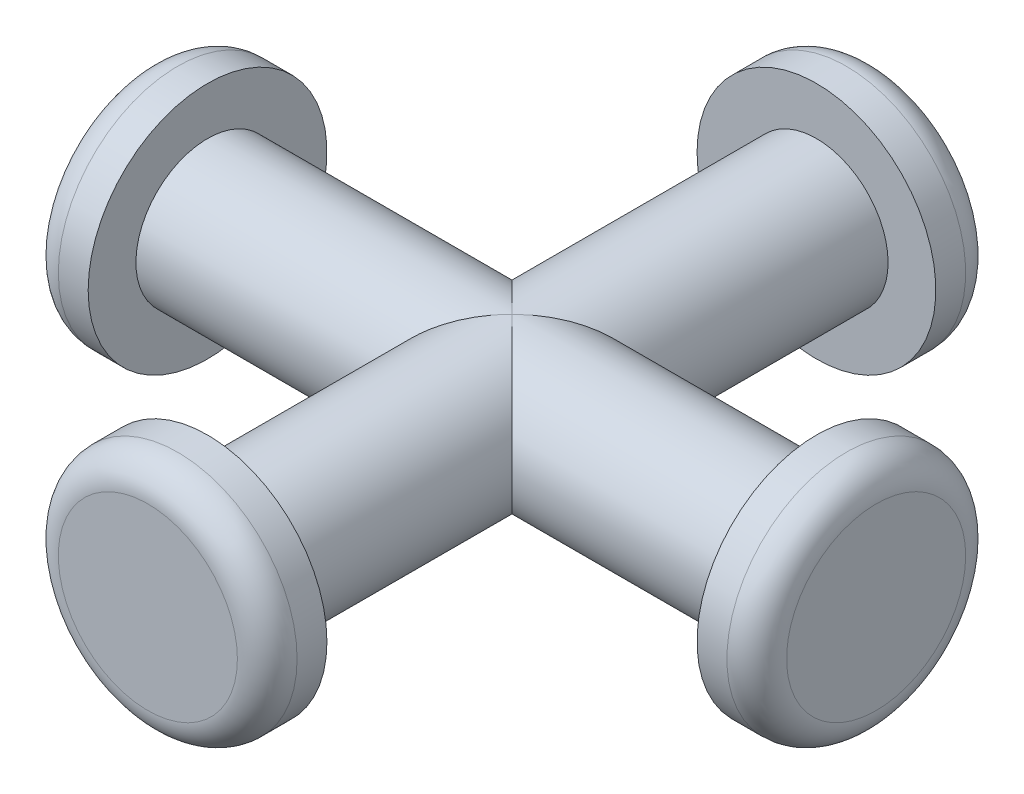
ISO-10303-21;
HEADER;
FILE_DESCRIPTION(('STEP AP214'),'2;1');
FILE_NAME('part.step','',(''),(''),'','','');
FILE_SCHEMA(('AUTOMOTIVE_DESIGN { 1 0 10303 214 1 1 1 1 }'));
ENDSEC;
DATA;
#1=APPLICATION_CONTEXT('core data for automotive mechanical design processes');
#2=APPLICATION_PROTOCOL_DEFINITION('international standard','automotive_design',2000,#1);
#3=PRODUCT_CONTEXT('',#1,'mechanical');
#4=PRODUCT('Part','Part','',(#3));
#5=PRODUCT_RELATED_PRODUCT_CATEGORY('part','',(#4));
#6=PRODUCT_DEFINITION_FORMATION('','',#4);
#7=PRODUCT_DEFINITION_CONTEXT('part definition',#1,'design');
#8=PRODUCT_DEFINITION('design','',#6,#7);
#9=PRODUCT_DEFINITION_SHAPE('','',#8);
#10=(LENGTH_UNIT() NAMED_UNIT(*) SI_UNIT(.MILLI.,.METRE.));
#11=(NAMED_UNIT(*) PLANE_ANGLE_UNIT() SI_UNIT($,.RADIAN.));
#12=(NAMED_UNIT(*) SI_UNIT($,.STERADIAN.) SOLID_ANGLE_UNIT());
#13=UNCERTAINTY_MEASURE_WITH_UNIT(LENGTH_MEASURE(1.E-05),#10,'distance_accuracy_value','');
#14=(GEOMETRIC_REPRESENTATION_CONTEXT(3) GLOBAL_UNCERTAINTY_ASSIGNED_CONTEXT((#13)) GLOBAL_UNIT_ASSIGNED_CONTEXT((#10,
#11,#12)) REPRESENTATION_CONTEXT('',''));
#15=CARTESIAN_POINT('',(0.,0.,0.));
#16=DIRECTION('',(0.,0.,1.));
#17=DIRECTION('',(1.,0.,0.));
#18=AXIS2_PLACEMENT_3D('',#15,#16,#17);
#19=CARTESIAN_POINT('',(0.,0.,10.2));
#20=DIRECTION('',(0.,0.,-1.));
#21=DIRECTION('',(-1.,0.,0.));
#22=AXIS2_PLACEMENT_3D('',#19,#20,#21);
#23=CYLINDRICAL_SURFACE('',#22,2.4);
#24=CARTESIAN_POINT('',(0.,0.,10.2));
#25=DIRECTION('',(0.,0.,1.));
#26=DIRECTION('',(1.,0.,0.));
#27=AXIS2_PLACEMENT_3D('',#24,#25,#26);
#28=CIRCLE('',#27,2.4);
#29=CARTESIAN_POINT('',(2.4,0.,10.2));
#30=VERTEX_POINT('',#29);
#31=EDGE_CURVE('E61',#30,#30,#28,.T.);
#32=ORIENTED_EDGE('',*,*,#31,.F.);
#33=EDGE_LOOP('',(#32));
#34=FACE_BOUND('',#33,.T.);
#35=CARTESIAN_POINT('',(0.,0.,0.));
#36=DIRECTION('',(-0.707106781186547,0.,-0.707106781186547));
#37=DIRECTION('',(0.707106781186547,0.,-0.707106781186547));
#38=AXIS2_PLACEMENT_3D('',#35,#36,#37);
#39=ELLIPSE('',#38,3.39411254969543,2.4);
#40=CARTESIAN_POINT('',(0.,-2.4,0.));
#41=VERTEX_POINT('',#40);
#42=CARTESIAN_POINT('',(0.,2.4,0.));
#43=VERTEX_POINT('',#42);
#44=EDGE_CURVE('E54',#41,#43,#39,.T.);
#45=ORIENTED_EDGE('',*,*,#44,.F.);
#46=CARTESIAN_POINT('',(0.,0.,0.));
#47=DIRECTION('',(0.707106781186547,0.,-0.707106781186547));
#48=DIRECTION('',(-0.707106781186547,0.,-0.707106781186547));
#49=AXIS2_PLACEMENT_3D('',#46,#47,#48);
#50=ELLIPSE('',#49,3.39411254969543,2.4);
#51=EDGE_CURVE('E53',#43,#41,#50,.T.);
#52=ORIENTED_EDGE('',*,*,#51,.F.);
#53=EDGE_LOOP('',(#45,#52));
#54=FACE_BOUND('',#53,.T.);
#55=ADVANCED_FACE('F33',(#34,#54),#23,.T.);
#56=CARTESIAN_POINT('',(10.2,0.,0.));
#57=DIRECTION('',(-1.,0.,0.));
#58=DIRECTION('',(0.,0.,1.));
#59=AXIS2_PLACEMENT_3D('',#56,#57,#58);
#60=CYLINDRICAL_SURFACE('',#59,2.4);
#61=CARTESIAN_POINT('',(-10.2,0.,0.));
#62=DIRECTION('',(1.,0.,0.));
#63=DIRECTION('',(0.,0.,-1.));
#64=AXIS2_PLACEMENT_3D('',#61,#62,#63);
#65=CIRCLE('',#64,2.4);
#66=CARTESIAN_POINT('',(-10.2,0.,-2.4));
#67=VERTEX_POINT('',#66);
#68=EDGE_CURVE('E132',#67,#67,#65,.T.);
#69=ORIENTED_EDGE('',*,*,#68,.T.);
#70=EDGE_LOOP('',(#69));
#71=FACE_BOUND('',#70,.T.);
#72=CARTESIAN_POINT('',(0.,0.,0.));
#73=DIRECTION('',(0.707106781186547,0.,-0.707106781186547));
#74=DIRECTION('',(-0.707106781186547,0.,-0.707106781186547));
#75=AXIS2_PLACEMENT_3D('',#72,#73,#74);
#76=ELLIPSE('',#75,3.39411254969543,2.4);
#77=EDGE_CURVE('E47',#43,#41,#76,.F.);
#78=ORIENTED_EDGE('',*,*,#77,.T.);
#79=ORIENTED_EDGE('',*,*,#44,.T.);
#80=EDGE_LOOP('',(#78,#79));
#81=FACE_BOUND('',#80,.T.);
#82=ADVANCED_FACE('F63',(#71,#81),#60,.T.);
#83=CARTESIAN_POINT('',(0.,0.,-10.2));
#84=DIRECTION('',(0.,0.,1.));
#85=DIRECTION('',(1.,0.,0.));
#86=AXIS2_PLACEMENT_3D('',#83,#84,#85);
#87=CIRCLE('',#86,2.4);
#88=CARTESIAN_POINT('',(2.4,0.,-10.2));
#89=VERTEX_POINT('',#88);
#90=EDGE_CURVE('E118',#89,#89,#87,.T.);
#91=ORIENTED_EDGE('',*,*,#90,.T.);
#92=EDGE_LOOP('',(#91));
#93=FACE_BOUND('',#92,.T.);
#94=CARTESIAN_POINT('',(0.,0.,0.));
#95=DIRECTION('',(-0.707106781186547,0.,-0.707106781186547));
#96=DIRECTION('',(0.707106781186547,0.,-0.707106781186547));
#97=AXIS2_PLACEMENT_3D('',#94,#95,#96);
#98=ELLIPSE('',#97,3.39411254969543,2.4);
#99=EDGE_CURVE('E60',#41,#43,#98,.F.);
#100=ORIENTED_EDGE('',*,*,#99,.F.);
#101=ORIENTED_EDGE('',*,*,#77,.F.);
#102=EDGE_LOOP('',(#100,#101));
#103=FACE_BOUND('',#102,.T.);
#104=ADVANCED_FACE('F59',(#93,#103),#23,.T.);
#105=CARTESIAN_POINT('',(10.2,0.,0.));
#106=DIRECTION('',(1.,0.,0.));
#107=DIRECTION('',(0.,0.,-1.));
#108=AXIS2_PLACEMENT_3D('',#105,#106,#107);
#109=CIRCLE('',#108,2.4);
#110=CARTESIAN_POINT('',(10.2,0.,-2.4));
#111=VERTEX_POINT('',#110);
#112=EDGE_CURVE('E131',#111,#111,#109,.T.);
#113=ORIENTED_EDGE('',*,*,#112,.F.);
#114=EDGE_LOOP('',(#113));
#115=FACE_BOUND('',#114,.T.);
#116=ORIENTED_EDGE('',*,*,#51,.T.);
#117=ORIENTED_EDGE('',*,*,#99,.T.);
#118=EDGE_LOOP('',(#116,#117));
#119=FACE_BOUND('',#118,.T.);
#120=ADVANCED_FACE('F65',(#115,#119),#60,.T.);
#121=CARTESIAN_POINT('',(12.2,0.,0.));
#122=DIRECTION('',(-1.,0.,0.));
#123=DIRECTION('',(0.,0.,1.));
#124=AXIS2_PLACEMENT_3D('',#121,#122,#123);
#125=CYLINDRICAL_SURFACE('',#124,4.);
#126=CARTESIAN_POINT('',(11.2,0.,0.));
#127=DIRECTION('',(1.,0.,0.));
#128=DIRECTION('',(0.,0.,-1.));
#129=AXIS2_PLACEMENT_3D('',#126,#127,#128);
#130=CIRCLE('',#129,4.);
#131=CARTESIAN_POINT('',(11.2,0.,-4.));
#132=VERTEX_POINT('',#131);
#133=EDGE_CURVE('E83',#132,#132,#130,.F.);
#134=ORIENTED_EDGE('',*,*,#133,.T.);
#135=EDGE_LOOP('',(#134));
#136=FACE_BOUND('',#135,.T.);
#137=CARTESIAN_POINT('',(10.2,0.,0.));
#138=DIRECTION('',(1.,0.,0.));
#139=DIRECTION('',(0.,0.,-1.));
#140=AXIS2_PLACEMENT_3D('',#137,#138,#139);
#141=CIRCLE('',#140,4.);
#142=CARTESIAN_POINT('',(10.2,0.,-4.));
#143=VERTEX_POINT('',#142);
#144=EDGE_CURVE('E135',#143,#143,#141,.T.);
#145=ORIENTED_EDGE('',*,*,#144,.T.);
#146=EDGE_LOOP('',(#145));
#147=FACE_BOUND('',#146,.T.);
#148=ADVANCED_FACE('F114',(#136,#147),#125,.T.);
#149=CARTESIAN_POINT('',(12.2,0.,0.));
#150=DIRECTION('',(1.,0.,0.));
#151=DIRECTION('',(0.,0.,-1.));
#152=AXIS2_PLACEMENT_3D('',#149,#150,#151);
#153=PLANE('',#152);
#154=CARTESIAN_POINT('',(12.2,0.,0.));
#155=DIRECTION('',(1.,0.,0.));
#156=DIRECTION('',(0.,0.,-1.));
#157=AXIS2_PLACEMENT_3D('',#154,#155,#156);
#158=CIRCLE('',#157,3.);
#159=CARTESIAN_POINT('',(12.2,0.,-3.));
#160=VERTEX_POINT('',#159);
#161=EDGE_CURVE('E80',#160,#160,#158,.T.);
#162=ORIENTED_EDGE('',*,*,#161,.T.);
#163=EDGE_LOOP('',(#162));
#164=FACE_BOUND('',#163,.T.);
#165=ADVANCED_FACE('F165',(#164),#153,.T.);
#166=CARTESIAN_POINT('',(10.2,0.,0.));
#167=DIRECTION('',(1.,0.,0.));
#168=DIRECTION('',(0.,0.,-1.));
#169=AXIS2_PLACEMENT_3D('',#166,#167,#168);
#170=PLANE('',#169);
#171=ORIENTED_EDGE('',*,*,#112,.T.);
#172=EDGE_LOOP('',(#171));
#173=FACE_BOUND('',#172,.T.);
#174=ORIENTED_EDGE('',*,*,#144,.F.);
#175=EDGE_LOOP('',(#174));
#176=FACE_BOUND('',#175,.T.);
#177=ADVANCED_FACE('F163',(#173,#176),#170,.F.);
#178=CARTESIAN_POINT('',(-12.2,0.,0.));
#179=DIRECTION('',(1.,0.,0.));
#180=DIRECTION('',(0.,0.,-1.));
#181=AXIS2_PLACEMENT_3D('',#178,#179,#180);
#182=CYLINDRICAL_SURFACE('',#181,4.);
#183=CARTESIAN_POINT('',(-11.2,0.,0.));
#184=DIRECTION('',(-1.,0.,0.));
#185=DIRECTION('',(0.,0.,1.));
#186=AXIS2_PLACEMENT_3D('',#183,#184,#185);
#187=CIRCLE('',#186,4.);
#188=CARTESIAN_POINT('',(-11.2,0.,4.));
#189=VERTEX_POINT('',#188);
#190=EDGE_CURVE('E69',#189,#189,#187,.F.);
#191=ORIENTED_EDGE('',*,*,#190,.T.);
#192=EDGE_LOOP('',(#191));
#193=FACE_BOUND('',#192,.T.);
#194=CARTESIAN_POINT('',(-10.2,0.,0.));
#195=DIRECTION('',(-1.,0.,0.));
#196=DIRECTION('',(0.,0.,1.));
#197=AXIS2_PLACEMENT_3D('',#194,#195,#196);
#198=CIRCLE('',#197,4.);
#199=CARTESIAN_POINT('',(-10.2,0.,4.));
#200=VERTEX_POINT('',#199);
#201=EDGE_CURVE('E124',#200,#200,#198,.T.);
#202=ORIENTED_EDGE('',*,*,#201,.T.);
#203=EDGE_LOOP('',(#202));
#204=FACE_BOUND('',#203,.T.);
#205=ADVANCED_FACE('F143',(#193,#204),#182,.T.);
#206=CARTESIAN_POINT('',(-12.2,0.,0.));
#207=DIRECTION('',(-1.,0.,0.));
#208=DIRECTION('',(0.,0.,1.));
#209=AXIS2_PLACEMENT_3D('',#206,#207,#208);
#210=PLANE('',#209);
#211=CARTESIAN_POINT('',(-12.2,0.,0.));
#212=DIRECTION('',(-1.,0.,0.));
#213=DIRECTION('',(0.,0.,1.));
#214=AXIS2_PLACEMENT_3D('',#211,#212,#213);
#215=CIRCLE('',#214,3.);
#216=CARTESIAN_POINT('',(-12.2,0.,3.));
#217=VERTEX_POINT('',#216);
#218=EDGE_CURVE('E66',#217,#217,#215,.T.);
#219=ORIENTED_EDGE('',*,*,#218,.T.);
#220=EDGE_LOOP('',(#219));
#221=FACE_BOUND('',#220,.T.);
#222=ADVANCED_FACE('F148',(#221),#210,.T.);
#223=CARTESIAN_POINT('',(-10.2,0.,0.));
#224=DIRECTION('',(-1.,0.,0.));
#225=DIRECTION('',(0.,0.,1.));
#226=AXIS2_PLACEMENT_3D('',#223,#224,#225);
#227=PLANE('',#226);
#228=ORIENTED_EDGE('',*,*,#68,.F.);
#229=EDGE_LOOP('',(#228));
#230=FACE_BOUND('',#229,.T.);
#231=ORIENTED_EDGE('',*,*,#201,.F.);
#232=EDGE_LOOP('',(#231));
#233=FACE_BOUND('',#232,.T.);
#234=ADVANCED_FACE('F145',(#230,#233),#227,.F.);
#235=CARTESIAN_POINT('',(0.,0.,12.2));
#236=DIRECTION('',(0.,0.,-1.));
#237=DIRECTION('',(-1.,0.,0.));
#238=AXIS2_PLACEMENT_3D('',#235,#236,#237);
#239=CYLINDRICAL_SURFACE('',#238,4.);
#240=CARTESIAN_POINT('',(0.,0.,11.2));
#241=DIRECTION('',(0.,0.,1.));
#242=DIRECTION('',(1.,0.,0.));
#243=AXIS2_PLACEMENT_3D('',#240,#241,#242);
#244=CIRCLE('',#243,4.);
#245=CARTESIAN_POINT('',(4.,0.,11.2));
#246=VERTEX_POINT('',#245);
#247=EDGE_CURVE('E11',#246,#246,#244,.F.);
#248=ORIENTED_EDGE('',*,*,#247,.T.);
#249=EDGE_LOOP('',(#248));
#250=FACE_BOUND('',#249,.T.);
#251=CARTESIAN_POINT('',(0.,0.,10.2));
#252=DIRECTION('',(0.,0.,1.));
#253=DIRECTION('',(1.,0.,0.));
#254=AXIS2_PLACEMENT_3D('',#251,#252,#253);
#255=CIRCLE('',#254,4.);
#256=CARTESIAN_POINT('',(4.,0.,10.2));
#257=VERTEX_POINT('',#256);
#258=EDGE_CURVE('E120',#257,#257,#255,.T.);
#259=ORIENTED_EDGE('',*,*,#258,.T.);
#260=EDGE_LOOP('',(#259));
#261=FACE_BOUND('',#260,.T.);
#262=ADVANCED_FACE('F147',(#250,#261),#239,.T.);
#263=CARTESIAN_POINT('',(0.,0.,12.2));
#264=DIRECTION('',(0.,0.,1.));
#265=DIRECTION('',(1.,0.,0.));
#266=AXIS2_PLACEMENT_3D('',#263,#264,#265);
#267=PLANE('',#266);
#268=CARTESIAN_POINT('',(0.,0.,12.2));
#269=DIRECTION('',(0.,0.,1.));
#270=DIRECTION('',(1.,0.,0.));
#271=AXIS2_PLACEMENT_3D('',#268,#269,#270);
#272=CIRCLE('',#271,3.);
#273=CARTESIAN_POINT('',(3.,0.,12.2));
#274=VERTEX_POINT('',#273);
#275=EDGE_CURVE('E41',#274,#274,#272,.T.);
#276=ORIENTED_EDGE('',*,*,#275,.T.);
#277=EDGE_LOOP('',(#276));
#278=FACE_BOUND('',#277,.T.);
#279=ADVANCED_FACE('F88',(#278),#267,.T.);
#280=CARTESIAN_POINT('',(0.,0.,10.2));
#281=DIRECTION('',(0.,0.,1.));
#282=DIRECTION('',(1.,0.,0.));
#283=AXIS2_PLACEMENT_3D('',#280,#281,#282);
#284=PLANE('',#283);
#285=ORIENTED_EDGE('',*,*,#31,.T.);
#286=EDGE_LOOP('',(#285));
#287=FACE_BOUND('',#286,.T.);
#288=ORIENTED_EDGE('',*,*,#258,.F.);
#289=EDGE_LOOP('',(#288));
#290=FACE_BOUND('',#289,.T.);
#291=ADVANCED_FACE('F217',(#287,#290),#284,.F.);
#292=CARTESIAN_POINT('',(0.,0.,-12.2));
#293=DIRECTION('',(0.,0.,1.));
#294=DIRECTION('',(1.,0.,0.));
#295=AXIS2_PLACEMENT_3D('',#292,#293,#294);
#296=CYLINDRICAL_SURFACE('',#295,4.);
#297=CARTESIAN_POINT('',(0.,0.,-11.2));
#298=DIRECTION('',(0.,0.,-1.));
#299=DIRECTION('',(-1.,0.,0.));
#300=AXIS2_PLACEMENT_3D('',#297,#298,#299);
#301=CIRCLE('',#300,4.);
#302=CARTESIAN_POINT('',(-4.,0.,-11.2));
#303=VERTEX_POINT('',#302);
#304=EDGE_CURVE('E77',#303,#303,#301,.F.);
#305=ORIENTED_EDGE('',*,*,#304,.T.);
#306=EDGE_LOOP('',(#305));
#307=FACE_BOUND('',#306,.T.);
#308=CARTESIAN_POINT('',(0.,0.,-10.2));
#309=DIRECTION('',(0.,0.,-1.));
#310=DIRECTION('',(-1.,0.,0.));
#311=AXIS2_PLACEMENT_3D('',#308,#309,#310);
#312=CIRCLE('',#311,4.);
#313=CARTESIAN_POINT('',(-4.,0.,-10.2));
#314=VERTEX_POINT('',#313);
#315=EDGE_CURVE('E121',#314,#314,#312,.T.);
#316=ORIENTED_EDGE('',*,*,#315,.T.);
#317=EDGE_LOOP('',(#316));
#318=FACE_BOUND('',#317,.T.);
#319=ADVANCED_FACE('F224',(#307,#318),#296,.T.);
#320=CARTESIAN_POINT('',(0.,0.,-12.2));
#321=DIRECTION('',(0.,0.,-1.));
#322=DIRECTION('',(-1.,0.,0.));
#323=AXIS2_PLACEMENT_3D('',#320,#321,#322);
#324=PLANE('',#323);
#325=CARTESIAN_POINT('',(0.,0.,-12.2));
#326=DIRECTION('',(0.,0.,-1.));
#327=DIRECTION('',(-1.,0.,0.));
#328=AXIS2_PLACEMENT_3D('',#325,#326,#327);
#329=CIRCLE('',#328,3.);
#330=CARTESIAN_POINT('',(-3.,0.,-12.2));
#331=VERTEX_POINT('',#330);
#332=EDGE_CURVE('E74',#331,#331,#329,.T.);
#333=ORIENTED_EDGE('',*,*,#332,.T.);
#334=EDGE_LOOP('',(#333));
#335=FACE_BOUND('',#334,.T.);
#336=ADVANCED_FACE('F229',(#335),#324,.T.);
#337=CARTESIAN_POINT('',(0.,0.,-10.2));
#338=DIRECTION('',(0.,0.,-1.));
#339=DIRECTION('',(-1.,0.,0.));
#340=AXIS2_PLACEMENT_3D('',#337,#338,#339);
#341=PLANE('',#340);
#342=ORIENTED_EDGE('',*,*,#90,.F.);
#343=EDGE_LOOP('',(#342));
#344=FACE_BOUND('',#343,.T.);
#345=ORIENTED_EDGE('',*,*,#315,.F.);
#346=EDGE_LOOP('',(#345));
#347=FACE_BOUND('',#346,.T.);
#348=ADVANCED_FACE('F239',(#344,#347),#341,.F.);
#349=CARTESIAN_POINT('',(-11.2,0.,0.));
#350=DIRECTION('',(-1.,0.,0.));
#351=DIRECTION('',(0.,0.,1.));
#352=AXIS2_PLACEMENT_3D('',#349,#350,#351);
#353=TOROIDAL_SURFACE('',#352,3.,1.);
#354=ORIENTED_EDGE('',*,*,#190,.F.);
#355=EDGE_LOOP('',(#354));
#356=FACE_BOUND('',#355,.T.);
#357=ORIENTED_EDGE('',*,*,#218,.F.);
#358=EDGE_LOOP('',(#357));
#359=FACE_BOUND('',#358,.T.);
#360=ADVANCED_FACE('F247',(#356,#359),#353,.T.);
#361=CARTESIAN_POINT('',(0.,0.,-11.2));
#362=DIRECTION('',(0.,0.,-1.));
#363=DIRECTION('',(-1.,0.,0.));
#364=AXIS2_PLACEMENT_3D('',#361,#362,#363);
#365=TOROIDAL_SURFACE('',#364,3.,1.);
#366=ORIENTED_EDGE('',*,*,#304,.F.);
#367=EDGE_LOOP('',(#366));
#368=FACE_BOUND('',#367,.T.);
#369=ORIENTED_EDGE('',*,*,#332,.F.);
#370=EDGE_LOOP('',(#369));
#371=FACE_BOUND('',#370,.T.);
#372=ADVANCED_FACE('F96',(#368,#371),#365,.T.);
#373=CARTESIAN_POINT('',(11.2,0.,0.));
#374=DIRECTION('',(1.,0.,0.));
#375=DIRECTION('',(0.,0.,-1.));
#376=AXIS2_PLACEMENT_3D('',#373,#374,#375);
#377=TOROIDAL_SURFACE('',#376,3.,1.);
#378=ORIENTED_EDGE('',*,*,#133,.F.);
#379=EDGE_LOOP('',(#378));
#380=FACE_BOUND('',#379,.T.);
#381=ORIENTED_EDGE('',*,*,#161,.F.);
#382=EDGE_LOOP('',(#381));
#383=FACE_BOUND('',#382,.T.);
#384=ADVANCED_FACE('F91',(#380,#383),#377,.T.);
#385=CARTESIAN_POINT('',(0.,0.,11.2));
#386=DIRECTION('',(0.,0.,1.));
#387=DIRECTION('',(1.,0.,0.));
#388=AXIS2_PLACEMENT_3D('',#385,#386,#387);
#389=TOROIDAL_SURFACE('',#388,3.,1.);
#390=ORIENTED_EDGE('',*,*,#247,.F.);
#391=EDGE_LOOP('',(#390));
#392=FACE_BOUND('',#391,.T.);
#393=ORIENTED_EDGE('',*,*,#275,.F.);
#394=EDGE_LOOP('',(#393));
#395=FACE_BOUND('',#394,.T.);
#396=ADVANCED_FACE('F35',(#392,#395),#389,.T.);
#397=CLOSED_SHELL('',(#55,#82,#104,#120,#148,#165,#177,#205,#222,#234,#262,#279,#291,#319,#336,
#348,#360,#372,#384,#396));
#398=MANIFOLD_SOLID_BREP('B2',#397);
#399=ADVANCED_BREP_SHAPE_REPRESENTATION('',(#18,#398),#14);
#400=SHAPE_DEFINITION_REPRESENTATION(#9,#399);
ENDSEC;
END-ISO-10303-21;
